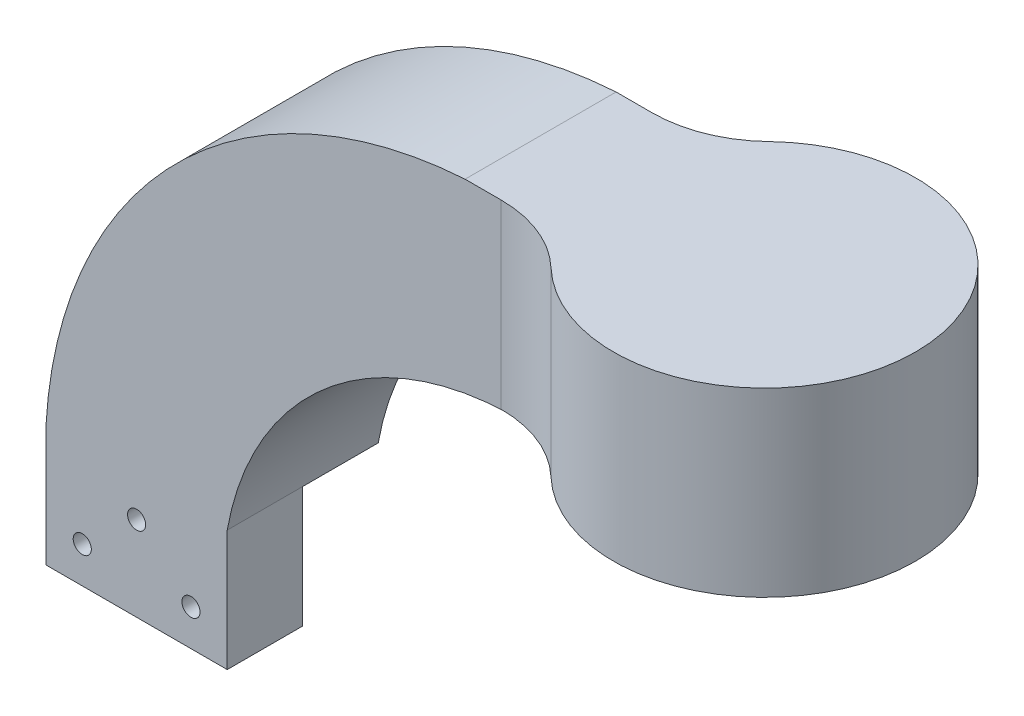
ISO-10303-21;
HEADER;
FILE_DESCRIPTION(('STEP AP214'),'2;1');
FILE_NAME('part.step','',(''),(''),'','','');
FILE_SCHEMA(('AUTOMOTIVE_DESIGN { 1 0 10303 214 1 1 1 1 }'));
ENDSEC;
DATA;
#1=APPLICATION_CONTEXT('core data for automotive mechanical design processes');
#2=APPLICATION_PROTOCOL_DEFINITION('international standard','automotive_design',2000,#1);
#3=PRODUCT_CONTEXT('',#1,'mechanical');
#4=PRODUCT('Part','Part','',(#3));
#5=PRODUCT_RELATED_PRODUCT_CATEGORY('part','',(#4));
#6=PRODUCT_DEFINITION_FORMATION('','',#4);
#7=PRODUCT_DEFINITION_CONTEXT('part definition',#1,'design');
#8=PRODUCT_DEFINITION('design','',#6,#7);
#9=PRODUCT_DEFINITION_SHAPE('','',#8);
#10=(LENGTH_UNIT() NAMED_UNIT(*) SI_UNIT(.MILLI.,.METRE.));
#11=(NAMED_UNIT(*) PLANE_ANGLE_UNIT() SI_UNIT($,.RADIAN.));
#12=(NAMED_UNIT(*) SI_UNIT($,.STERADIAN.) SOLID_ANGLE_UNIT());
#13=UNCERTAINTY_MEASURE_WITH_UNIT(LENGTH_MEASURE(1.E-05),#10,'distance_accuracy_value','');
#14=(GEOMETRIC_REPRESENTATION_CONTEXT(3) GLOBAL_UNCERTAINTY_ASSIGNED_CONTEXT((#13)) GLOBAL_UNIT_ASSIGNED_CONTEXT((#10,
#11,#12)) REPRESENTATION_CONTEXT('',''));
#15=CARTESIAN_POINT('',(0.,0.,0.));
#16=DIRECTION('',(0.,0.,1.));
#17=DIRECTION('',(1.,0.,0.));
#18=AXIS2_PLACEMENT_3D('',#15,#16,#17);
#19=CARTESIAN_POINT('',(0.,0.,-25.));
#20=DIRECTION('',(-1.,0.,0.));
#21=DIRECTION('',(0.,0.,-1.));
#22=AXIS2_PLACEMENT_3D('',#19,#20,#21);
#23=PLANE('',#22);
#24=DIRECTION('',(0.,0.,1.));
#25=VECTOR('',#24,1.);
#26=CARTESIAN_POINT('',(0.,0.,-25.));
#27=LINE('',#26,#25);
#28=CARTESIAN_POINT('',(0.,0.,-12.5));
#29=VERTEX_POINT('',#28);
#30=CARTESIAN_POINT('',(0.,0.,0.));
#31=VERTEX_POINT('',#30);
#32=EDGE_CURVE('E158',#29,#31,#27,.T.);
#33=ORIENTED_EDGE('',*,*,#32,.T.);
#34=DIRECTION('',(0.,1.,0.));
#35=VECTOR('',#34,1.);
#36=CARTESIAN_POINT('',(0.,0.,0.));
#37=LINE('',#36,#35);
#38=CARTESIAN_POINT('',(0.,20.,0.));
#39=VERTEX_POINT('',#38);
#40=EDGE_CURVE('E157',#31,#39,#37,.T.);
#41=ORIENTED_EDGE('',*,*,#40,.T.);
#42=DIRECTION('',(0.,0.,1.));
#43=VECTOR('',#42,1.);
#44=CARTESIAN_POINT('',(0.,20.,-25.));
#45=LINE('',#44,#43);
#46=CARTESIAN_POINT('',(0.,20.,-12.5));
#47=VERTEX_POINT('',#46);
#48=EDGE_CURVE('E141',#47,#39,#45,.T.);
#49=ORIENTED_EDGE('',*,*,#48,.F.);
#50=DIRECTION('',(0.,1.,0.));
#51=VECTOR('',#50,1.);
#52=CARTESIAN_POINT('',(0.,0.,-12.5));
#53=LINE('',#52,#51);
#54=EDGE_CURVE('E148',#29,#47,#53,.T.);
#55=ORIENTED_EDGE('',*,*,#54,.F.);
#56=EDGE_LOOP('',(#33,#41,#49,#55));
#57=FACE_BOUND('',#56,.T.);
#58=ADVANCED_FACE('F39',(#57),#23,.T.);
#59=CARTESIAN_POINT('',(0.,0.,-25.));
#60=DIRECTION('',(0.,1.,0.));
#61=DIRECTION('',(0.,0.,-1.));
#62=AXIS2_PLACEMENT_3D('',#59,#60,#61);
#63=PLANE('',#62);
#64=DIRECTION('',(-1.,0.,0.));
#65=VECTOR('',#64,1.);
#66=CARTESIAN_POINT('',(49.,0.,-12.5));
#67=LINE('',#66,#65);
#68=CARTESIAN_POINT('',(30.,0.,-12.5));
#69=VERTEX_POINT('',#68);
#70=EDGE_CURVE('E134',#69,#29,#67,.T.);
#71=ORIENTED_EDGE('',*,*,#70,.F.);
#72=DIRECTION('',(0.,0.,1.));
#73=VECTOR('',#72,1.);
#74=CARTESIAN_POINT('',(30.,0.,-25.));
#75=LINE('',#74,#73);
#76=CARTESIAN_POINT('',(30.,0.,0.));
#77=VERTEX_POINT('',#76);
#78=EDGE_CURVE('E159',#69,#77,#75,.T.);
#79=ORIENTED_EDGE('',*,*,#78,.T.);
#80=DIRECTION('',(1.,0.,0.));
#81=VECTOR('',#80,1.);
#82=CARTESIAN_POINT('',(0.,0.,0.));
#83=LINE('',#82,#81);
#84=EDGE_CURVE('E186',#31,#77,#83,.T.);
#85=ORIENTED_EDGE('',*,*,#84,.F.);
#86=ORIENTED_EDGE('',*,*,#32,.F.);
#87=EDGE_LOOP('',(#71,#79,#85,#86));
#88=FACE_BOUND('',#87,.T.);
#89=ADVANCED_FACE('F203',(#88),#63,.F.);
#90=CARTESIAN_POINT('',(30.,0.,-25.));
#91=DIRECTION('',(-1.,0.,0.));
#92=DIRECTION('',(0.,0.,-1.));
#93=AXIS2_PLACEMENT_3D('',#90,#91,#92);
#94=PLANE('',#93);
#95=DIRECTION('',(0.,1.,0.));
#96=VECTOR('',#95,1.);
#97=CARTESIAN_POINT('',(30.,0.,-12.5));
#98=LINE('',#97,#96);
#99=CARTESIAN_POINT('',(30.,20.,-12.5));
#100=VERTEX_POINT('',#99);
#101=EDGE_CURVE('E11',#69,#100,#98,.T.);
#102=ORIENTED_EDGE('',*,*,#101,.T.);
#103=DIRECTION('',(0.,0.,1.));
#104=VECTOR('',#103,1.);
#105=CARTESIAN_POINT('',(30.,20.,-25.));
#106=LINE('',#105,#104);
#107=CARTESIAN_POINT('',(30.,20.,0.));
#108=VERTEX_POINT('',#107);
#109=EDGE_CURVE('E199',#100,#108,#106,.T.);
#110=ORIENTED_EDGE('',*,*,#109,.T.);
#111=DIRECTION('',(0.,1.,0.));
#112=VECTOR('',#111,1.);
#113=CARTESIAN_POINT('',(30.,0.,0.));
#114=LINE('',#113,#112);
#115=EDGE_CURVE('E189',#77,#108,#114,.T.);
#116=ORIENTED_EDGE('',*,*,#115,.F.);
#117=ORIENTED_EDGE('',*,*,#78,.F.);
#118=EDGE_LOOP('',(#102,#110,#116,#117));
#119=FACE_BOUND('',#118,.T.);
#120=ADVANCED_FACE('F205',(#119),#94,.F.);
#121=CARTESIAN_POINT('',(0.,0.,-25.));
#122=DIRECTION('',(0.,0.,-1.));
#123=DIRECTION('',(1.,0.,0.));
#124=AXIS2_PLACEMENT_3D('',#121,#122,#123);
#125=PLANE('',#124);
#126=CARTESIAN_POINT('',(74.1286015594169,15.9110557941245,-25.));
#127=DIRECTION('',(0.,0.,1.));
#128=DIRECTION('',(1.,0.,0.));
#129=AXIS2_PLACEMENT_3D('',#126,#127,#128);
#130=CIRCLE('',#129,74.2412892794404);
#131=CARTESIAN_POINT('',(0.,20.,-25.));
#132=VERTEX_POINT('',#131);
#133=CARTESIAN_POINT('',(69.3749313634287,90.,-25.));
#134=VERTEX_POINT('',#133);
#135=EDGE_CURVE('E144',#132,#134,#130,.F.);
#136=ORIENTED_EDGE('',*,*,#135,.T.);
#137=DIRECTION('',(1.,0.,0.));
#138=VECTOR('',#137,1.);
#139=CARTESIAN_POINT('',(0.,90.,-25.));
#140=LINE('',#139,#138);
#141=CARTESIAN_POINT('',(75.3178028920965,90.,-25.));
#142=VERTEX_POINT('',#141);
#143=EDGE_CURVE('E174',#134,#142,#140,.T.);
#144=ORIENTED_EDGE('',*,*,#143,.T.);
#145=DIRECTION('',(0.,1.,0.));
#146=VECTOR('',#145,1.);
#147=CARTESIAN_POINT('',(75.3178028920965,-19.7018790083806,-25.));
#148=LINE('',#147,#146);
#149=CARTESIAN_POINT('',(75.3178028920965,60.,-25.));
#150=VERTEX_POINT('',#149);
#151=EDGE_CURVE('E210',#150,#142,#148,.T.);
#152=ORIENTED_EDGE('',*,*,#151,.F.);
#153=DIRECTION('',(-1.,0.,0.));
#154=VECTOR('',#153,1.);
#155=CARTESIAN_POINT('',(0.,60.,-25.));
#156=LINE('',#155,#154);
#157=CARTESIAN_POINT('',(76.2846202203655,60.,-25.));
#158=VERTEX_POINT('',#157);
#159=EDGE_CURVE('E171',#158,#150,#156,.T.);
#160=ORIENTED_EDGE('',*,*,#159,.F.);
#161=CARTESIAN_POINT('',(77.7490601432993,11.5271479964934,-25.));
#162=DIRECTION('',(0.,0.,1.));
#163=DIRECTION('',(1.,0.,0.));
#164=AXIS2_PLACEMENT_3D('',#161,#162,#163);
#165=CIRCLE('',#164,48.494968456962);
#166=CARTESIAN_POINT('',(30.,20.,-25.));
#167=VERTEX_POINT('',#166);
#168=EDGE_CURVE('E168',#167,#158,#165,.F.);
#169=ORIENTED_EDGE('',*,*,#168,.F.);
#170=DIRECTION('',(1.,0.,0.));
#171=VECTOR('',#170,1.);
#172=CARTESIAN_POINT('',(0.,20.,-25.));
#173=LINE('',#172,#171);
#174=EDGE_CURVE('E47',#132,#167,#173,.T.);
#175=ORIENTED_EDGE('',*,*,#174,.F.);
#176=EDGE_LOOP('',(#136,#144,#152,#160,#169,#175));
#177=FACE_BOUND('',#176,.T.);
#178=ADVANCED_FACE('F169',(#177),#125,.T.);
#179=CARTESIAN_POINT('',(77.7490601432993,11.5271479964934,-25.));
#180=DIRECTION('',(0.,0.,1.));
#181=DIRECTION('',(-1.,0.,0.));
#182=AXIS2_PLACEMENT_3D('',#179,#180,#181);
#183=CYLINDRICAL_SURFACE('',#182,48.494968456962);
#184=DIRECTION('',(0.,0.,1.));
#185=VECTOR('',#184,1.);
#186=CARTESIAN_POINT('',(76.2846202203655,60.,-25.));
#187=LINE('',#186,#185);
#188=CARTESIAN_POINT('',(76.2846202203655,60.,0.));
#189=VERTEX_POINT('',#188);
#190=EDGE_CURVE('E227',#158,#189,#187,.T.);
#191=ORIENTED_EDGE('',*,*,#190,.T.);
#192=CARTESIAN_POINT('',(77.7490601432993,11.5271479964934,0.));
#193=DIRECTION('',(0.,0.,1.));
#194=DIRECTION('',(1.,0.,0.));
#195=AXIS2_PLACEMENT_3D('',#192,#193,#194);
#196=CIRCLE('',#195,48.494968456962);
#197=EDGE_CURVE('E192',#108,#189,#196,.F.);
#198=ORIENTED_EDGE('',*,*,#197,.F.);
#199=ORIENTED_EDGE('',*,*,#109,.F.);
#200=EDGE_CURVE('E130',#167,#100,#106,.T.);
#201=ORIENTED_EDGE('',*,*,#200,.F.);
#202=ORIENTED_EDGE('',*,*,#168,.T.);
#203=EDGE_LOOP('',(#191,#198,#199,#201,#202));
#204=FACE_BOUND('',#203,.T.);
#205=ADVANCED_FACE('F230',(#204),#183,.F.);
#206=CARTESIAN_POINT('',(74.1286015594169,15.9110557941245,-25.));
#207=DIRECTION('',(0.,0.,1.));
#208=DIRECTION('',(-1.,0.,0.));
#209=AXIS2_PLACEMENT_3D('',#206,#207,#208);
#210=CYLINDRICAL_SURFACE('',#209,74.2412892794404);
#211=CARTESIAN_POINT('',(74.1286015594169,15.9110557941245,0.));
#212=DIRECTION('',(0.,0.,1.));
#213=DIRECTION('',(1.,0.,0.));
#214=AXIS2_PLACEMENT_3D('',#211,#212,#213);
#215=CIRCLE('',#214,74.2412892794404);
#216=CARTESIAN_POINT('',(69.3749313634287,90.,0.));
#217=VERTEX_POINT('',#216);
#218=EDGE_CURVE('E183',#39,#217,#215,.F.);
#219=ORIENTED_EDGE('',*,*,#218,.T.);
#220=DIRECTION('',(0.,0.,1.));
#221=VECTOR('',#220,1.);
#222=CARTESIAN_POINT('',(69.3749313634287,90.,-25.));
#223=LINE('',#222,#221);
#224=EDGE_CURVE('E177',#134,#217,#223,.T.);
#225=ORIENTED_EDGE('',*,*,#224,.F.);
#226=ORIENTED_EDGE('',*,*,#135,.F.);
#227=EDGE_CURVE('E128',#132,#47,#45,.T.);
#228=ORIENTED_EDGE('',*,*,#227,.T.);
#229=ORIENTED_EDGE('',*,*,#48,.T.);
#230=EDGE_LOOP('',(#219,#225,#226,#228,#229));
#231=FACE_BOUND('',#230,.T.);
#232=ADVANCED_FACE('F41',(#231),#210,.T.);
#233=CARTESIAN_POINT('',(0.,90.,-25.));
#234=DIRECTION('',(0.,1.,0.));
#235=DIRECTION('',(0.,0.,-1.));
#236=AXIS2_PLACEMENT_3D('',#233,#234,#235);
#237=PLANE('',#236);
#238=DIRECTION('',(1.,0.,0.));
#239=VECTOR('',#238,1.);
#240=CARTESIAN_POINT('',(0.,90.,0.));
#241=LINE('',#240,#239);
#242=CARTESIAN_POINT('',(75.3178028920965,90.,0.));
#243=VERTEX_POINT('',#242);
#244=EDGE_CURVE('E179',#217,#243,#241,.T.);
#245=ORIENTED_EDGE('',*,*,#244,.T.);
#246=CARTESIAN_POINT('',(75.3178028920965,90.,20.));
#247=DIRECTION('',(0.,1.,0.));
#248=DIRECTION('',(0.,0.,-1.));
#249=AXIS2_PLACEMENT_3D('',#246,#247,#248);
#250=CIRCLE('',#249,20.);
#251=CARTESIAN_POINT('',(89.1510246676395,90.,5.55555555555556));
#252=VERTEX_POINT('',#251);
#253=EDGE_CURVE('E219',#252,#243,#250,.T.);
#254=ORIENTED_EDGE('',*,*,#253,.F.);
#255=CARTESIAN_POINT('',(106.442551887068,90.,-12.5));
#256=DIRECTION('',(0.,-1.,0.));
#257=DIRECTION('',(0.,0.,-1.));
#258=AXIS2_PLACEMENT_3D('',#255,#256,#257);
#259=CIRCLE('',#258,25.);
#260=CARTESIAN_POINT('',(89.1510246676395,90.,-30.5555555555556));
#261=VERTEX_POINT('',#260);
#262=EDGE_CURVE('E238',#261,#252,#259,.T.);
#263=ORIENTED_EDGE('',*,*,#262,.F.);
#264=CARTESIAN_POINT('',(75.3178028920965,90.,-45.));
#265=DIRECTION('',(0.,1.,0.));
#266=DIRECTION('',(0.,0.,1.));
#267=AXIS2_PLACEMENT_3D('',#264,#265,#266);
#268=CIRCLE('',#267,20.);
#269=EDGE_CURVE('E62',#142,#261,#268,.T.);
#270=ORIENTED_EDGE('',*,*,#269,.F.);
#271=ORIENTED_EDGE('',*,*,#143,.F.);
#272=ORIENTED_EDGE('',*,*,#224,.T.);
#273=EDGE_LOOP('',(#245,#254,#263,#270,#271,#272));
#274=FACE_BOUND('',#273,.T.);
#275=ADVANCED_FACE('F209',(#274),#237,.T.);
#276=CARTESIAN_POINT('',(0.,0.,0.));
#277=DIRECTION('',(0.,0.,-1.));
#278=DIRECTION('',(1.,0.,0.));
#279=AXIS2_PLACEMENT_3D('',#276,#277,#278);
#280=PLANE('',#279);
#281=CARTESIAN_POINT('',(24.,6.,0.));
#282=DIRECTION('',(0.,0.,1.));
#283=DIRECTION('',(1.,0.,0.));
#284=AXIS2_PLACEMENT_3D('',#281,#282,#283);
#285=CIRCLE('',#284,1.5);
#286=CARTESIAN_POINT('',(25.5,6.,0.));
#287=VERTEX_POINT('',#286);
#288=EDGE_CURVE('E154',#287,#287,#285,.T.);
#289=ORIENTED_EDGE('',*,*,#288,.F.);
#290=EDGE_LOOP('',(#289));
#291=FACE_BOUND('',#290,.T.);
#292=CARTESIAN_POINT('',(6.,6.,0.));
#293=DIRECTION('',(0.,0.,1.));
#294=DIRECTION('',(1.,0.,0.));
#295=AXIS2_PLACEMENT_3D('',#292,#293,#294);
#296=CIRCLE('',#295,1.5);
#297=CARTESIAN_POINT('',(7.5,6.,0.));
#298=VERTEX_POINT('',#297);
#299=EDGE_CURVE('E246',#298,#298,#296,.T.);
#300=ORIENTED_EDGE('',*,*,#299,.F.);
#301=EDGE_LOOP('',(#300));
#302=FACE_BOUND('',#301,.T.);
#303=CARTESIAN_POINT('',(15.,14.,0.));
#304=DIRECTION('',(0.,0.,1.));
#305=DIRECTION('',(1.,0.,0.));
#306=AXIS2_PLACEMENT_3D('',#303,#304,#305);
#307=CIRCLE('',#306,1.5);
#308=CARTESIAN_POINT('',(16.5,14.,0.));
#309=VERTEX_POINT('',#308);
#310=EDGE_CURVE('E249',#309,#309,#307,.T.);
#311=ORIENTED_EDGE('',*,*,#310,.F.);
#312=EDGE_LOOP('',(#311));
#313=FACE_BOUND('',#312,.T.);
#314=ORIENTED_EDGE('',*,*,#218,.F.);
#315=ORIENTED_EDGE('',*,*,#40,.F.);
#316=ORIENTED_EDGE('',*,*,#84,.T.);
#317=ORIENTED_EDGE('',*,*,#115,.T.);
#318=ORIENTED_EDGE('',*,*,#197,.T.);
#319=DIRECTION('',(-1.,0.,0.));
#320=VECTOR('',#319,1.);
#321=CARTESIAN_POINT('',(0.,60.,0.));
#322=LINE('',#321,#320);
#323=CARTESIAN_POINT('',(75.3178028920965,60.,0.));
#324=VERTEX_POINT('',#323);
#325=EDGE_CURVE('E145',#189,#324,#322,.T.);
#326=ORIENTED_EDGE('',*,*,#325,.T.);
#327=DIRECTION('',(0.,1.,0.));
#328=VECTOR('',#327,1.);
#329=CARTESIAN_POINT('',(75.3178028920965,-19.7018790083806,0.));
#330=LINE('',#329,#328);
#331=EDGE_CURVE('E212',#324,#243,#330,.T.);
#332=ORIENTED_EDGE('',*,*,#331,.T.);
#333=ORIENTED_EDGE('',*,*,#244,.F.);
#334=EDGE_LOOP('',(#314,#315,#316,#317,#318,#326,#332,#333));
#335=FACE_BOUND('',#334,.T.);
#336=ADVANCED_FACE('F208',(#291,#302,#313,#335),#280,.F.);
#337=CARTESIAN_POINT('',(75.3178028920965,-19.7018790083806,-45.));
#338=DIRECTION('',(0.,1.,0.));
#339=DIRECTION('',(0.,0.,-1.));
#340=AXIS2_PLACEMENT_3D('',#337,#338,#339);
#341=CYLINDRICAL_SURFACE('',#340,20.);
#342=CARTESIAN_POINT('',(75.3178028920965,60.,-45.));
#343=DIRECTION('',(0.,-1.,0.));
#344=DIRECTION('',(0.,0.,-1.));
#345=AXIS2_PLACEMENT_3D('',#342,#343,#344);
#346=CIRCLE('',#345,20.);
#347=CARTESIAN_POINT('',(89.1510246676395,60.,-30.5555555555556));
#348=VERTEX_POINT('',#347);
#349=EDGE_CURVE('E54',#348,#150,#346,.T.);
#350=ORIENTED_EDGE('',*,*,#349,.T.);
#351=ORIENTED_EDGE('',*,*,#151,.T.);
#352=ORIENTED_EDGE('',*,*,#269,.T.);
#353=DIRECTION('',(0.,1.,0.));
#354=VECTOR('',#353,1.);
#355=CARTESIAN_POINT('',(89.1510246676395,-19.7018790083806,-30.5555555555556));
#356=LINE('',#355,#354);
#357=EDGE_CURVE('E223',#348,#261,#356,.T.);
#358=ORIENTED_EDGE('',*,*,#357,.F.);
#359=EDGE_LOOP('',(#350,#351,#352,#358));
#360=FACE_BOUND('',#359,.T.);
#361=ADVANCED_FACE('F273',(#360),#341,.F.);
#362=CARTESIAN_POINT('',(75.3178028920965,-19.7018790083806,20.));
#363=DIRECTION('',(0.,1.,0.));
#364=DIRECTION('',(0.,0.,-1.));
#365=AXIS2_PLACEMENT_3D('',#362,#363,#364);
#366=CYLINDRICAL_SURFACE('',#365,20.);
#367=CARTESIAN_POINT('',(75.3178028920965,60.,20.));
#368=DIRECTION('',(0.,-1.,0.));
#369=DIRECTION('',(0.,0.,-1.));
#370=AXIS2_PLACEMENT_3D('',#367,#368,#369);
#371=CIRCLE('',#370,20.);
#372=CARTESIAN_POINT('',(89.1510246676395,60.,5.55555555555556));
#373=VERTEX_POINT('',#372);
#374=EDGE_CURVE('E211',#324,#373,#371,.T.);
#375=ORIENTED_EDGE('',*,*,#374,.T.);
#376=DIRECTION('',(0.,1.,0.));
#377=VECTOR('',#376,1.);
#378=CARTESIAN_POINT('',(89.1510246676395,-19.7018790083806,5.55555555555556));
#379=LINE('',#378,#377);
#380=EDGE_CURVE('E216',#373,#252,#379,.T.);
#381=ORIENTED_EDGE('',*,*,#380,.T.);
#382=ORIENTED_EDGE('',*,*,#253,.T.);
#383=ORIENTED_EDGE('',*,*,#331,.F.);
#384=EDGE_LOOP('',(#375,#381,#382,#383));
#385=FACE_BOUND('',#384,.T.);
#386=ADVANCED_FACE('F235',(#385),#366,.F.);
#387=CARTESIAN_POINT('',(106.442551887068,-19.7018790083806,-12.5));
#388=DIRECTION('',(0.,1.,0.));
#389=DIRECTION('',(0.,0.,-1.));
#390=AXIS2_PLACEMENT_3D('',#387,#388,#389);
#391=CYLINDRICAL_SURFACE('',#390,25.);
#392=CARTESIAN_POINT('',(106.442551887068,60.,-12.5));
#393=DIRECTION('',(0.,-1.,0.));
#394=DIRECTION('',(0.,0.,-1.));
#395=AXIS2_PLACEMENT_3D('',#392,#393,#394);
#396=CIRCLE('',#395,25.);
#397=EDGE_CURVE('E225',#373,#348,#396,.F.);
#398=ORIENTED_EDGE('',*,*,#397,.T.);
#399=ORIENTED_EDGE('',*,*,#357,.T.);
#400=ORIENTED_EDGE('',*,*,#262,.T.);
#401=ORIENTED_EDGE('',*,*,#380,.F.);
#402=EDGE_LOOP('',(#398,#399,#400,#401));
#403=FACE_BOUND('',#402,.T.);
#404=ADVANCED_FACE('F303',(#403),#391,.T.);
#405=CARTESIAN_POINT('',(0.,60.,-25.));
#406=DIRECTION('',(0.,1.,0.));
#407=DIRECTION('',(0.,0.,-1.));
#408=AXIS2_PLACEMENT_3D('',#405,#406,#407);
#409=PLANE('',#408);
#410=ORIENTED_EDGE('',*,*,#159,.T.);
#411=ORIENTED_EDGE('',*,*,#349,.F.);
#412=ORIENTED_EDGE('',*,*,#397,.F.);
#413=ORIENTED_EDGE('',*,*,#374,.F.);
#414=ORIENTED_EDGE('',*,*,#325,.F.);
#415=ORIENTED_EDGE('',*,*,#190,.F.);
#416=EDGE_LOOP('',(#410,#411,#412,#413,#414,#415));
#417=FACE_BOUND('',#416,.T.);
#418=ADVANCED_FACE('F229',(#417),#409,.F.);
#419=CARTESIAN_POINT('',(49.,0.,-12.5));
#420=DIRECTION('',(0.,0.,-1.));
#421=DIRECTION('',(1.,0.,0.));
#422=AXIS2_PLACEMENT_3D('',#419,#420,#421);
#423=PLANE('',#422);
#424=CARTESIAN_POINT('',(24.,6.,-12.5));
#425=DIRECTION('',(0.,0.,1.));
#426=DIRECTION('',(1.,0.,0.));
#427=AXIS2_PLACEMENT_3D('',#424,#425,#426);
#428=CIRCLE('',#427,1.5);
#429=CARTESIAN_POINT('',(25.5,6.,-12.5));
#430=VERTEX_POINT('',#429);
#431=EDGE_CURVE('E252',#430,#430,#428,.T.);
#432=ORIENTED_EDGE('',*,*,#431,.T.);
#433=EDGE_LOOP('',(#432));
#434=FACE_BOUND('',#433,.T.);
#435=CARTESIAN_POINT('',(6.,6.,-12.5));
#436=DIRECTION('',(0.,0.,1.));
#437=DIRECTION('',(1.,0.,0.));
#438=AXIS2_PLACEMENT_3D('',#435,#436,#437);
#439=CIRCLE('',#438,1.5);
#440=CARTESIAN_POINT('',(7.5,6.,-12.5));
#441=VERTEX_POINT('',#440);
#442=EDGE_CURVE('E256',#441,#441,#439,.T.);
#443=ORIENTED_EDGE('',*,*,#442,.T.);
#444=EDGE_LOOP('',(#443));
#445=FACE_BOUND('',#444,.T.);
#446=CARTESIAN_POINT('',(15.,14.,-12.5));
#447=DIRECTION('',(0.,0.,1.));
#448=DIRECTION('',(1.,0.,0.));
#449=AXIS2_PLACEMENT_3D('',#446,#447,#448);
#450=CIRCLE('',#449,1.5);
#451=CARTESIAN_POINT('',(16.5,14.,-12.5));
#452=VERTEX_POINT('',#451);
#453=EDGE_CURVE('E253',#452,#452,#450,.T.);
#454=ORIENTED_EDGE('',*,*,#453,.T.);
#455=EDGE_LOOP('',(#454));
#456=FACE_BOUND('',#455,.T.);
#457=ORIENTED_EDGE('',*,*,#101,.F.);
#458=ORIENTED_EDGE('',*,*,#70,.T.);
#459=ORIENTED_EDGE('',*,*,#54,.T.);
#460=DIRECTION('',(-1.,0.,0.));
#461=VECTOR('',#460,1.);
#462=CARTESIAN_POINT('',(49.,20.,-12.5));
#463=LINE('',#462,#461);
#464=EDGE_CURVE('E124',#100,#47,#463,.T.);
#465=ORIENTED_EDGE('',*,*,#464,.F.);
#466=EDGE_LOOP('',(#457,#458,#459,#465));
#467=FACE_BOUND('',#466,.T.);
#468=ADVANCED_FACE('F149',(#434,#445,#456,#467),#423,.T.);
#469=CARTESIAN_POINT('',(49.,20.,-12.5));
#470=DIRECTION('',(0.,-1.,0.));
#471=DIRECTION('',(0.,0.,1.));
#472=AXIS2_PLACEMENT_3D('',#469,#470,#471);
#473=PLANE('',#472);
#474=ORIENTED_EDGE('',*,*,#200,.T.);
#475=ORIENTED_EDGE('',*,*,#464,.T.);
#476=ORIENTED_EDGE('',*,*,#227,.F.);
#477=ORIENTED_EDGE('',*,*,#174,.T.);
#478=EDGE_LOOP('',(#474,#475,#476,#477));
#479=FACE_BOUND('',#478,.T.);
#480=ADVANCED_FACE('F126',(#479),#473,.T.);
#481=CARTESIAN_POINT('',(15.,14.,36.5));
#482=DIRECTION('',(0.,0.,-1.));
#483=DIRECTION('',(1.,0.,0.));
#484=AXIS2_PLACEMENT_3D('',#481,#482,#483);
#485=CYLINDRICAL_SURFACE('',#484,1.5);
#486=ORIENTED_EDGE('',*,*,#453,.F.);
#487=EDGE_LOOP('',(#486));
#488=FACE_BOUND('',#487,.T.);
#489=ORIENTED_EDGE('',*,*,#310,.T.);
#490=EDGE_LOOP('',(#489));
#491=FACE_BOUND('',#490,.T.);
#492=ADVANCED_FACE('F279',(#488,#491),#485,.F.);
#493=CARTESIAN_POINT('',(6.,6.,36.5));
#494=DIRECTION('',(0.,0.,-1.));
#495=DIRECTION('',(1.,0.,0.));
#496=AXIS2_PLACEMENT_3D('',#493,#494,#495);
#497=CYLINDRICAL_SURFACE('',#496,1.5);
#498=ORIENTED_EDGE('',*,*,#442,.F.);
#499=EDGE_LOOP('',(#498));
#500=FACE_BOUND('',#499,.T.);
#501=ORIENTED_EDGE('',*,*,#299,.T.);
#502=EDGE_LOOP('',(#501));
#503=FACE_BOUND('',#502,.T.);
#504=ADVANCED_FACE('F267',(#500,#503),#497,.F.);
#505=CARTESIAN_POINT('',(24.,6.,36.5));
#506=DIRECTION('',(0.,0.,-1.));
#507=DIRECTION('',(1.,0.,0.));
#508=AXIS2_PLACEMENT_3D('',#505,#506,#507);
#509=CYLINDRICAL_SURFACE('',#508,1.5);
#510=ORIENTED_EDGE('',*,*,#431,.F.);
#511=EDGE_LOOP('',(#510));
#512=FACE_BOUND('',#511,.T.);
#513=ORIENTED_EDGE('',*,*,#288,.T.);
#514=EDGE_LOOP('',(#513));
#515=FACE_BOUND('',#514,.T.);
#516=ADVANCED_FACE('F264',(#512,#515),#509,.F.);
#517=CLOSED_SHELL('',(#58,#89,#120,#178,#205,#232,#275,#336,#361,#386,#404,#418,#468,#480,#492,
#504,#516));
#518=MANIFOLD_SOLID_BREP('B2',#517);
#519=ADVANCED_BREP_SHAPE_REPRESENTATION('',(#18,#518),#14);
#520=SHAPE_DEFINITION_REPRESENTATION(#9,#519);
ENDSEC;
END-ISO-10303-21;
